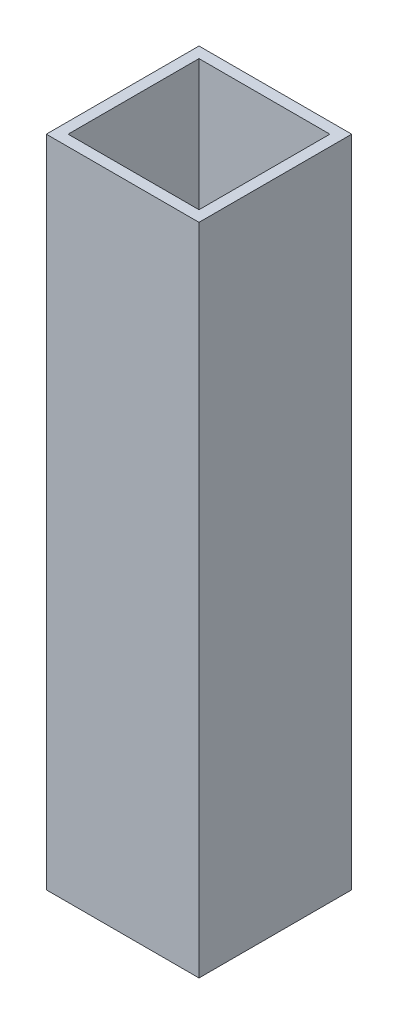
ISO-10303-21;
HEADER;
FILE_DESCRIPTION(('STEP AP214'),'2;1');
FILE_NAME('part.step','',(''),(''),'','','');
FILE_SCHEMA(('AUTOMOTIVE_DESIGN { 1 0 10303 214 1 1 1 1 }'));
ENDSEC;
DATA;
#1=APPLICATION_CONTEXT('core data for automotive mechanical design processes');
#2=APPLICATION_PROTOCOL_DEFINITION('international standard','automotive_design',2000,#1);
#3=PRODUCT_CONTEXT('',#1,'mechanical');
#4=PRODUCT('Part','Part','',(#3));
#5=PRODUCT_RELATED_PRODUCT_CATEGORY('part','',(#4));
#6=PRODUCT_DEFINITION_FORMATION('','',#4);
#7=PRODUCT_DEFINITION_CONTEXT('part definition',#1,'design');
#8=PRODUCT_DEFINITION('design','',#6,#7);
#9=PRODUCT_DEFINITION_SHAPE('','',#8);
#10=(LENGTH_UNIT() NAMED_UNIT(*) SI_UNIT(.MILLI.,.METRE.));
#11=(NAMED_UNIT(*) PLANE_ANGLE_UNIT() SI_UNIT($,.RADIAN.));
#12=(NAMED_UNIT(*) SI_UNIT($,.STERADIAN.) SOLID_ANGLE_UNIT());
#13=UNCERTAINTY_MEASURE_WITH_UNIT(LENGTH_MEASURE(1.E-05),#10,'distance_accuracy_value','');
#14=(GEOMETRIC_REPRESENTATION_CONTEXT(3) GLOBAL_UNCERTAINTY_ASSIGNED_CONTEXT((#13)) GLOBAL_UNIT_ASSIGNED_CONTEXT((#10,
#11,#12)) REPRESENTATION_CONTEXT('',''));
#15=CARTESIAN_POINT('',(0.,0.,0.));
#16=DIRECTION('',(0.,0.,1.));
#17=DIRECTION('',(1.,0.,0.));
#18=AXIS2_PLACEMENT_3D('',#15,#16,#17);
#19=CARTESIAN_POINT('',(22.2249999999998,-95.25,22.225));
#20=DIRECTION('',(0.999999999999995,0.,0.));
#21=DIRECTION('',(0.,0.,-0.999999999999989));
#22=AXIS2_PLACEMENT_3D('',#19,#20,#21);
#23=PLANE('',#22);
#24=DIRECTION('',(0.,0.999999999999995,0.));
#25=VECTOR('',#24,1.);
#26=CARTESIAN_POINT('',(22.2249999999998,-95.25,-22.2250000000001));
#27=LINE('',#26,#25);
#28=CARTESIAN_POINT('',(22.2249999999998,-95.25,-22.2250000000001));
#29=VERTEX_POINT('',#28);
#30=CARTESIAN_POINT('',(22.2249999999998,95.2499999999974,-22.2249999999999));
#31=VERTEX_POINT('',#30);
#32=EDGE_CURVE('E44',#29,#31,#27,.T.);
#33=ORIENTED_EDGE('',*,*,#32,.T.);
#34=DIRECTION('',(0.,0.,-0.999999999999989));
#35=VECTOR('',#34,1.);
#36=CARTESIAN_POINT('',(22.2249999999998,95.2499999999974,22.225));
#37=LINE('',#36,#35);
#38=CARTESIAN_POINT('',(22.2249999999998,95.2499999999974,22.225));
#39=VERTEX_POINT('',#38);
#40=EDGE_CURVE('E143',#39,#31,#37,.T.);
#41=ORIENTED_EDGE('',*,*,#40,.F.);
#42=DIRECTION('',(0.,0.999999999999995,0.));
#43=VECTOR('',#42,1.);
#44=CARTESIAN_POINT('',(22.2249999999998,-95.25,22.225));
#45=LINE('',#44,#43);
#46=CARTESIAN_POINT('',(22.2249999999998,-95.25,22.225));
#47=VERTEX_POINT('',#46);
#48=EDGE_CURVE('E11',#47,#39,#45,.T.);
#49=ORIENTED_EDGE('',*,*,#48,.F.);
#50=DIRECTION('',(0.,0.,-0.999999999999989));
#51=VECTOR('',#50,1.);
#52=CARTESIAN_POINT('',(22.2249999999998,-95.25,22.225));
#53=LINE('',#52,#51);
#54=EDGE_CURVE('E171',#47,#29,#53,.T.);
#55=ORIENTED_EDGE('',*,*,#54,.T.);
#56=EDGE_LOOP('',(#33,#41,#49,#55));
#57=FACE_BOUND('',#56,.T.);
#58=ADVANCED_FACE('F41',(#57),#23,.T.);
#59=CARTESIAN_POINT('',(-22.2249999999998,-95.25,22.225));
#60=DIRECTION('',(0.,0.,0.999999999999989));
#61=DIRECTION('',(0.999999999999995,0.,0.));
#62=AXIS2_PLACEMENT_3D('',#59,#60,#61);
#63=PLANE('',#62);
#64=ORIENTED_EDGE('',*,*,#48,.T.);
#65=DIRECTION('',(0.999999999999995,0.,0.));
#66=VECTOR('',#65,1.);
#67=CARTESIAN_POINT('',(-22.2249999999998,95.2499999999974,22.225));
#68=LINE('',#67,#66);
#69=CARTESIAN_POINT('',(-22.2249999999998,95.2499999999974,22.225));
#70=VERTEX_POINT('',#69);
#71=EDGE_CURVE('E155',#70,#39,#68,.T.);
#72=ORIENTED_EDGE('',*,*,#71,.F.);
#73=DIRECTION('',(0.,0.999999999999995,0.));
#74=VECTOR('',#73,1.);
#75=CARTESIAN_POINT('',(-22.2249999999998,-95.25,22.225));
#76=LINE('',#75,#74);
#77=CARTESIAN_POINT('',(-22.2249999999998,-95.25,22.225));
#78=VERTEX_POINT('',#77);
#79=EDGE_CURVE('E50',#78,#70,#76,.T.);
#80=ORIENTED_EDGE('',*,*,#79,.F.);
#81=DIRECTION('',(0.999999999999995,0.,0.));
#82=VECTOR('',#81,1.);
#83=CARTESIAN_POINT('',(-22.2249999999998,-95.25,22.225));
#84=LINE('',#83,#82);
#85=EDGE_CURVE('E187',#78,#47,#84,.T.);
#86=ORIENTED_EDGE('',*,*,#85,.T.);
#87=EDGE_LOOP('',(#64,#72,#80,#86));
#88=FACE_BOUND('',#87,.T.);
#89=ADVANCED_FACE('F205',(#88),#63,.T.);
#90=CARTESIAN_POINT('',(-22.2249999999998,-95.25,22.225));
#91=DIRECTION('',(-0.999999999999995,0.,0.));
#92=DIRECTION('',(0.,0.,0.999999999999989));
#93=AXIS2_PLACEMENT_3D('',#90,#91,#92);
#94=PLANE('',#93);
#95=ORIENTED_EDGE('',*,*,#79,.T.);
#96=DIRECTION('',(0.,0.,0.999999999999989));
#97=VECTOR('',#96,1.);
#98=CARTESIAN_POINT('',(-22.2249999999998,95.2499999999974,22.225));
#99=LINE('',#98,#97);
#100=CARTESIAN_POINT('',(-22.2249999999998,95.2499999999974,-22.2250000000001));
#101=VERTEX_POINT('',#100);
#102=EDGE_CURVE('E151',#101,#70,#99,.T.);
#103=ORIENTED_EDGE('',*,*,#102,.F.);
#104=DIRECTION('',(0.,0.999999999999995,0.));
#105=VECTOR('',#104,1.);
#106=CARTESIAN_POINT('',(-22.2249999999998,-95.25,-22.2250000000001));
#107=LINE('',#106,#105);
#108=CARTESIAN_POINT('',(-22.2249999999998,-95.25,-22.2250000000001));
#109=VERTEX_POINT('',#108);
#110=EDGE_CURVE('E192',#109,#101,#107,.T.);
#111=ORIENTED_EDGE('',*,*,#110,.F.);
#112=DIRECTION('',(0.,0.,0.999999999999989));
#113=VECTOR('',#112,1.);
#114=CARTESIAN_POINT('',(-22.2249999999998,-95.25,22.225));
#115=LINE('',#114,#113);
#116=EDGE_CURVE('E183',#109,#78,#115,.T.);
#117=ORIENTED_EDGE('',*,*,#116,.T.);
#118=EDGE_LOOP('',(#95,#103,#111,#117));
#119=FACE_BOUND('',#118,.T.);
#120=ADVANCED_FACE('F211',(#119),#94,.T.);
#121=CARTESIAN_POINT('',(-22.2249999999998,-95.25,-22.2250000000001));
#122=DIRECTION('',(0.,0.,-0.999999999999989));
#123=DIRECTION('',(-0.999999999999995,0.,0.));
#124=AXIS2_PLACEMENT_3D('',#121,#122,#123);
#125=PLANE('',#124);
#126=ORIENTED_EDGE('',*,*,#110,.T.);
#127=DIRECTION('',(-0.999999999999995,0.,0.));
#128=VECTOR('',#127,1.);
#129=CARTESIAN_POINT('',(-22.2249999999998,95.2499999999974,-22.2250000000001));
#130=LINE('',#129,#128);
#131=EDGE_CURVE('E147',#31,#101,#130,.T.);
#132=ORIENTED_EDGE('',*,*,#131,.F.);
#133=ORIENTED_EDGE('',*,*,#32,.F.);
#134=DIRECTION('',(-0.999999999999995,0.,0.));
#135=VECTOR('',#134,1.);
#136=CARTESIAN_POINT('',(-22.2249999999998,-95.25,-22.2250000000001));
#137=LINE('',#136,#135);
#138=EDGE_CURVE('E179',#29,#109,#137,.T.);
#139=ORIENTED_EDGE('',*,*,#138,.T.);
#140=EDGE_LOOP('',(#126,#132,#133,#139));
#141=FACE_BOUND('',#140,.T.);
#142=ADVANCED_FACE('F200',(#141),#125,.T.);
#143=CARTESIAN_POINT('',(0.,-95.25,0.));
#144=DIRECTION('',(0.,-0.999999999999995,0.));
#145=DIRECTION('',(0.,0.,-0.999999999999989));
#146=AXIS2_PLACEMENT_3D('',#143,#144,#145);
#147=PLANE('',#146);
#148=DIRECTION('',(0.,0.,-0.999999999999989));
#149=VECTOR('',#148,1.);
#150=CARTESIAN_POINT('',(19.0499999999998,-95.25,19.05));
#151=LINE('',#150,#149);
#152=CARTESIAN_POINT('',(19.0499999999998,-95.25,19.05));
#153=VERTEX_POINT('',#152);
#154=CARTESIAN_POINT('',(19.0499999999998,-95.25,-19.05));
#155=VERTEX_POINT('',#154);
#156=EDGE_CURVE('E159',#153,#155,#151,.T.);
#157=ORIENTED_EDGE('',*,*,#156,.T.);
#158=DIRECTION('',(-0.999999999999995,0.,0.));
#159=VECTOR('',#158,1.);
#160=CARTESIAN_POINT('',(-19.0499999999998,-95.25,-19.05));
#161=LINE('',#160,#159);
#162=CARTESIAN_POINT('',(-19.0499999999998,-95.25,-19.05));
#163=VERTEX_POINT('',#162);
#164=EDGE_CURVE('E114',#155,#163,#161,.T.);
#165=ORIENTED_EDGE('',*,*,#164,.T.);
#166=DIRECTION('',(0.,0.,0.999999999999989));
#167=VECTOR('',#166,1.);
#168=CARTESIAN_POINT('',(-19.0499999999998,-95.25,19.05));
#169=LINE('',#168,#167);
#170=CARTESIAN_POINT('',(-19.0499999999998,-95.25,19.05));
#171=VERTEX_POINT('',#170);
#172=EDGE_CURVE('E58',#163,#171,#169,.T.);
#173=ORIENTED_EDGE('',*,*,#172,.T.);
#174=DIRECTION('',(0.999999999999995,0.,0.));
#175=VECTOR('',#174,1.);
#176=CARTESIAN_POINT('',(-19.0499999999998,-95.25,19.05));
#177=LINE('',#176,#175);
#178=EDGE_CURVE('E120',#171,#153,#177,.T.);
#179=ORIENTED_EDGE('',*,*,#178,.T.);
#180=EDGE_LOOP('',(#157,#165,#173,#179));
#181=FACE_BOUND('',#180,.T.);
#182=ORIENTED_EDGE('',*,*,#54,.F.);
#183=ORIENTED_EDGE('',*,*,#85,.F.);
#184=ORIENTED_EDGE('',*,*,#116,.F.);
#185=ORIENTED_EDGE('',*,*,#138,.F.);
#186=EDGE_LOOP('',(#182,#183,#184,#185));
#187=FACE_BOUND('',#186,.T.);
#188=ADVANCED_FACE('F209',(#181,#187),#147,.T.);
#189=CARTESIAN_POINT('',(19.0499999999998,-95.25,19.05));
#190=DIRECTION('',(0.999999999999995,0.,0.));
#191=DIRECTION('',(0.,0.,-0.999999999999989));
#192=AXIS2_PLACEMENT_3D('',#189,#190,#191);
#193=PLANE('',#192);
#194=DIRECTION('',(0.,0.999999999999995,0.));
#195=VECTOR('',#194,1.);
#196=CARTESIAN_POINT('',(19.0499999999998,-95.25,19.05));
#197=LINE('',#196,#195);
#198=CARTESIAN_POINT('',(19.0499999999998,95.2499999999974,19.05));
#199=VERTEX_POINT('',#198);
#200=EDGE_CURVE('E125',#153,#199,#197,.T.);
#201=ORIENTED_EDGE('',*,*,#200,.T.);
#202=DIRECTION('',(0.,0.,-0.999999999999989));
#203=VECTOR('',#202,1.);
#204=CARTESIAN_POINT('',(19.0499999999998,95.2499999999974,19.05));
#205=LINE('',#204,#203);
#206=CARTESIAN_POINT('',(19.0499999999998,95.2499999999974,-19.05));
#207=VERTEX_POINT('',#206);
#208=EDGE_CURVE('E123',#199,#207,#205,.T.);
#209=ORIENTED_EDGE('',*,*,#208,.T.);
#210=DIRECTION('',(0.,0.999999999999995,0.));
#211=VECTOR('',#210,1.);
#212=CARTESIAN_POINT('',(19.0499999999998,-95.25,-19.05));
#213=LINE('',#212,#211);
#214=EDGE_CURVE('E107',#155,#207,#213,.T.);
#215=ORIENTED_EDGE('',*,*,#214,.F.);
#216=ORIENTED_EDGE('',*,*,#156,.F.);
#217=EDGE_LOOP('',(#201,#209,#215,#216));
#218=FACE_BOUND('',#217,.T.);
#219=ADVANCED_FACE('F124',(#218),#193,.F.);
#220=CARTESIAN_POINT('',(-19.0499999999998,-95.25,19.05));
#221=DIRECTION('',(0.,0.,0.999999999999989));
#222=DIRECTION('',(0.999999999999995,0.,0.));
#223=AXIS2_PLACEMENT_3D('',#220,#221,#222);
#224=PLANE('',#223);
#225=DIRECTION('',(0.,0.999999999999995,0.));
#226=VECTOR('',#225,1.);
#227=CARTESIAN_POINT('',(-19.0499999999998,-95.25,19.05));
#228=LINE('',#227,#226);
#229=CARTESIAN_POINT('',(-19.0499999999998,95.2499999999974,19.05));
#230=VERTEX_POINT('',#229);
#231=EDGE_CURVE('E172',#171,#230,#228,.T.);
#232=ORIENTED_EDGE('',*,*,#231,.T.);
#233=DIRECTION('',(0.999999999999995,0.,0.));
#234=VECTOR('',#233,1.);
#235=CARTESIAN_POINT('',(-19.0499999999998,95.2499999999974,19.05));
#236=LINE('',#235,#234);
#237=EDGE_CURVE('E138',#230,#199,#236,.T.);
#238=ORIENTED_EDGE('',*,*,#237,.T.);
#239=ORIENTED_EDGE('',*,*,#200,.F.);
#240=ORIENTED_EDGE('',*,*,#178,.F.);
#241=EDGE_LOOP('',(#232,#238,#239,#240));
#242=FACE_BOUND('',#241,.T.);
#243=ADVANCED_FACE('F254',(#242),#224,.F.);
#244=CARTESIAN_POINT('',(-19.0499999999998,-95.25,19.05));
#245=DIRECTION('',(-0.999999999999995,0.,0.));
#246=DIRECTION('',(0.,0.,0.999999999999989));
#247=AXIS2_PLACEMENT_3D('',#244,#245,#246);
#248=PLANE('',#247);
#249=DIRECTION('',(0.,0.999999999999995,0.));
#250=VECTOR('',#249,1.);
#251=CARTESIAN_POINT('',(-19.0499999999998,-95.25,-19.05));
#252=LINE('',#251,#250);
#253=CARTESIAN_POINT('',(-19.0499999999998,95.2499999999974,-19.05));
#254=VERTEX_POINT('',#253);
#255=EDGE_CURVE('E119',#163,#254,#252,.T.);
#256=ORIENTED_EDGE('',*,*,#255,.T.);
#257=DIRECTION('',(0.,0.,0.999999999999989));
#258=VECTOR('',#257,1.);
#259=CARTESIAN_POINT('',(-19.0499999999998,95.2499999999974,19.05));
#260=LINE('',#259,#258);
#261=EDGE_CURVE('E133',#254,#230,#260,.T.);
#262=ORIENTED_EDGE('',*,*,#261,.T.);
#263=ORIENTED_EDGE('',*,*,#231,.F.);
#264=ORIENTED_EDGE('',*,*,#172,.F.);
#265=EDGE_LOOP('',(#256,#262,#263,#264));
#266=FACE_BOUND('',#265,.T.);
#267=ADVANCED_FACE('F263',(#266),#248,.F.);
#268=CARTESIAN_POINT('',(-19.0499999999998,-95.25,-19.05));
#269=DIRECTION('',(0.,0.,-0.999999999999989));
#270=DIRECTION('',(-0.999999999999995,0.,0.));
#271=AXIS2_PLACEMENT_3D('',#268,#269,#270);
#272=PLANE('',#271);
#273=ORIENTED_EDGE('',*,*,#214,.T.);
#274=DIRECTION('',(-0.999999999999995,0.,0.));
#275=VECTOR('',#274,1.);
#276=CARTESIAN_POINT('',(-19.0499999999998,95.2499999999974,-19.05));
#277=LINE('',#276,#275);
#278=EDGE_CURVE('E111',#207,#254,#277,.T.);
#279=ORIENTED_EDGE('',*,*,#278,.T.);
#280=ORIENTED_EDGE('',*,*,#255,.F.);
#281=ORIENTED_EDGE('',*,*,#164,.F.);
#282=EDGE_LOOP('',(#273,#279,#280,#281));
#283=FACE_BOUND('',#282,.T.);
#284=ADVANCED_FACE('F109',(#283),#272,.F.);
#285=CARTESIAN_POINT('',(0.,95.2499999999974,0.));
#286=DIRECTION('',(0.,-0.999999999999995,0.));
#287=DIRECTION('',(0.,0.,-0.999999999999989));
#288=AXIS2_PLACEMENT_3D('',#285,#286,#287);
#289=PLANE('',#288);
#290=ORIENTED_EDGE('',*,*,#40,.T.);
#291=ORIENTED_EDGE('',*,*,#131,.T.);
#292=ORIENTED_EDGE('',*,*,#102,.T.);
#293=ORIENTED_EDGE('',*,*,#71,.T.);
#294=EDGE_LOOP('',(#290,#291,#292,#293));
#295=FACE_BOUND('',#294,.T.);
#296=ORIENTED_EDGE('',*,*,#208,.F.);
#297=ORIENTED_EDGE('',*,*,#237,.F.);
#298=ORIENTED_EDGE('',*,*,#261,.F.);
#299=ORIENTED_EDGE('',*,*,#278,.F.);
#300=EDGE_LOOP('',(#296,#297,#298,#299));
#301=FACE_BOUND('',#300,.T.);
#302=ADVANCED_FACE('F131',(#295,#301),#289,.F.);
#303=CLOSED_SHELL('',(#58,#89,#120,#142,#188,#219,#243,#267,#284,#302));
#304=MANIFOLD_SOLID_BREP('B2',#303);
#305=ADVANCED_BREP_SHAPE_REPRESENTATION('',(#18,#304),#14);
#306=SHAPE_DEFINITION_REPRESENTATION(#9,#305);
ENDSEC;
END-ISO-10303-21;
